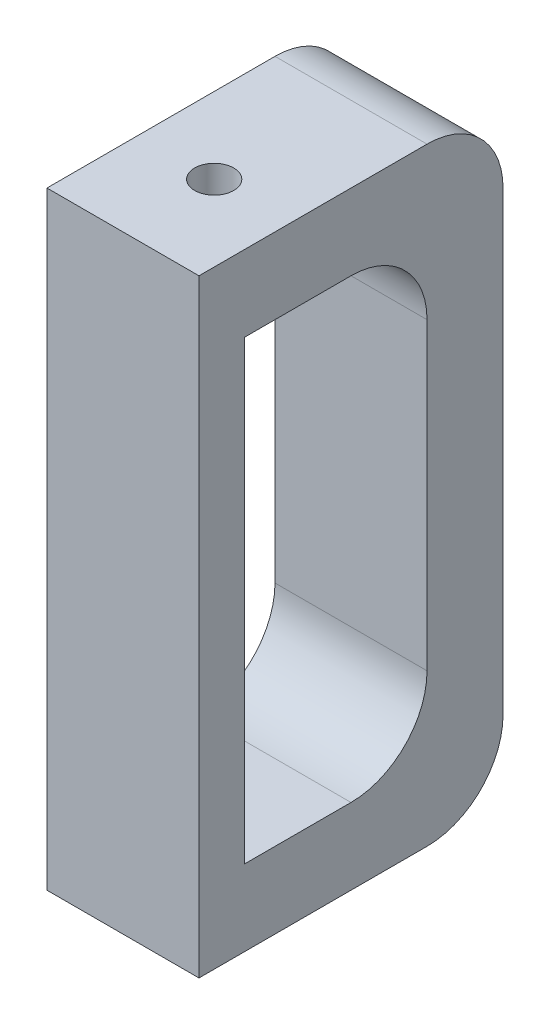
ISO-10303-21;
HEADER;
FILE_DESCRIPTION(('STEP AP214'),'2;1');
FILE_NAME('part.step','',(''),(''),'','','');
FILE_SCHEMA(('AUTOMOTIVE_DESIGN { 1 0 10303 214 1 1 1 1 }'));
ENDSEC;
DATA;
#1=APPLICATION_CONTEXT('core data for automotive mechanical design processes');
#2=APPLICATION_PROTOCOL_DEFINITION('international standard','automotive_design',2000,#1);
#3=PRODUCT_CONTEXT('',#1,'mechanical');
#4=PRODUCT('Part','Part','',(#3));
#5=PRODUCT_RELATED_PRODUCT_CATEGORY('part','',(#4));
#6=PRODUCT_DEFINITION_FORMATION('','',#4);
#7=PRODUCT_DEFINITION_CONTEXT('part definition',#1,'design');
#8=PRODUCT_DEFINITION('design','',#6,#7);
#9=PRODUCT_DEFINITION_SHAPE('','',#8);
#10=(LENGTH_UNIT() NAMED_UNIT(*) SI_UNIT(.MILLI.,.METRE.));
#11=(NAMED_UNIT(*) PLANE_ANGLE_UNIT() SI_UNIT($,.RADIAN.));
#12=(NAMED_UNIT(*) SI_UNIT($,.STERADIAN.) SOLID_ANGLE_UNIT());
#13=UNCERTAINTY_MEASURE_WITH_UNIT(LENGTH_MEASURE(1.E-05),#10,'distance_accuracy_value','');
#14=(GEOMETRIC_REPRESENTATION_CONTEXT(3) GLOBAL_UNCERTAINTY_ASSIGNED_CONTEXT((#13)) GLOBAL_UNIT_ASSIGNED_CONTEXT((#10,
#11,#12)) REPRESENTATION_CONTEXT('',''));
#15=CARTESIAN_POINT('',(0.,0.,0.));
#16=DIRECTION('',(0.,0.,1.));
#17=DIRECTION('',(1.,0.,0.));
#18=AXIS2_PLACEMENT_3D('',#15,#16,#17);
#19=CARTESIAN_POINT('',(0.,-101.6,0.));
#20=DIRECTION('',(0.,1.,0.));
#21=DIRECTION('',(0.,0.,1.));
#22=AXIS2_PLACEMENT_3D('',#19,#20,#21);
#23=PLANE('',#22);
#24=CARTESIAN_POINT('',(3.175,-101.6,-17.399));
#25=DIRECTION('',(0.,1.,0.));
#26=DIRECTION('',(0.,0.,1.));
#27=AXIS2_PLACEMENT_3D('',#24,#25,#26);
#28=CIRCLE('',#27,3.2639);
#29=CARTESIAN_POINT('',(3.175,-101.6,-14.1351));
#30=VERTEX_POINT('',#29);
#31=EDGE_CURVE('E339',#30,#30,#28,.F.);
#32=ORIENTED_EDGE('',*,*,#31,.F.);
#33=EDGE_LOOP('',(#32));
#34=FACE_BOUND('',#33,.T.);
#35=DIRECTION('',(-1.,0.,0.));
#36=VECTOR('',#35,1.);
#37=CARTESIAN_POINT('',(15.875,-101.6,-2.159));
#38=LINE('',#37,#36);
#39=CARTESIAN_POINT('',(15.875,-101.6,-2.159));
#40=VERTEX_POINT('',#39);
#41=CARTESIAN_POINT('',(-9.52500000000001,-101.6,-2.159));
#42=VERTEX_POINT('',#41);
#43=EDGE_CURVE('E245',#40,#42,#38,.T.);
#44=ORIENTED_EDGE('',*,*,#43,.T.);
#45=DIRECTION('',(0.,0.,1.));
#46=VECTOR('',#45,1.);
#47=CARTESIAN_POINT('',(-9.52500000000002,-101.6,-52.959));
#48=LINE('',#47,#46);
#49=CARTESIAN_POINT('',(-9.52500000000001,-101.6,-40.259));
#50=VERTEX_POINT('',#49);
#51=EDGE_CURVE('E50',#50,#42,#48,.T.);
#52=ORIENTED_EDGE('',*,*,#51,.F.);
#53=DIRECTION('',(1.,0.,0.));
#54=VECTOR('',#53,1.);
#55=CARTESIAN_POINT('',(-9.52500000000001,-101.6,-40.259));
#56=LINE('',#55,#54);
#57=CARTESIAN_POINT('',(15.875,-101.6,-40.259));
#58=VERTEX_POINT('',#57);
#59=EDGE_CURVE('E225',#50,#58,#56,.T.);
#60=ORIENTED_EDGE('',*,*,#59,.T.);
#61=DIRECTION('',(0.,0.,1.));
#62=VECTOR('',#61,1.);
#63=CARTESIAN_POINT('',(15.875,-101.6,-52.959));
#64=LINE('',#63,#62);
#65=EDGE_CURVE('E11',#58,#40,#64,.T.);
#66=ORIENTED_EDGE('',*,*,#65,.T.);
#67=EDGE_LOOP('',(#44,#52,#60,#66));
#68=FACE_BOUND('',#67,.T.);
#69=ADVANCED_FACE('F40',(#34,#68),#23,.F.);
#70=CARTESIAN_POINT('',(0.,0.,0.));
#71=DIRECTION('',(0.,1.,0.));
#72=DIRECTION('',(0.,0.,1.));
#73=AXIS2_PLACEMENT_3D('',#70,#71,#72);
#74=PLANE('',#73);
#75=DIRECTION('',(1.,0.,0.));
#76=VECTOR('',#75,1.);
#77=CARTESIAN_POINT('',(15.875,0.,-2.159));
#78=LINE('',#77,#76);
#79=CARTESIAN_POINT('',(-9.525,0.,-2.159));
#80=VERTEX_POINT('',#79);
#81=CARTESIAN_POINT('',(15.875,0.,-2.159));
#82=VERTEX_POINT('',#81);
#83=EDGE_CURVE('E237',#80,#82,#78,.T.);
#84=ORIENTED_EDGE('',*,*,#83,.T.);
#85=DIRECTION('',(0.,0.,1.));
#86=VECTOR('',#85,1.);
#87=CARTESIAN_POINT('',(15.875,0.,-52.959));
#88=LINE('',#87,#86);
#89=CARTESIAN_POINT('',(15.875,0.,-40.259));
#90=VERTEX_POINT('',#89);
#91=EDGE_CURVE('E241',#90,#82,#88,.T.);
#92=ORIENTED_EDGE('',*,*,#91,.F.);
#93=DIRECTION('',(1.,0.,0.));
#94=VECTOR('',#93,1.);
#95=CARTESIAN_POINT('',(-9.525,0.,-40.259));
#96=LINE('',#95,#94);
#97=CARTESIAN_POINT('',(-9.525,0.,-40.259));
#98=VERTEX_POINT('',#97);
#99=EDGE_CURVE('E208',#98,#90,#96,.T.);
#100=ORIENTED_EDGE('',*,*,#99,.F.);
#101=DIRECTION('',(0.,0.,1.));
#102=VECTOR('',#101,1.);
#103=CARTESIAN_POINT('',(-9.52500000000001,0.,-52.959));
#104=LINE('',#103,#102);
#105=EDGE_CURVE('E257',#98,#80,#104,.T.);
#106=ORIENTED_EDGE('',*,*,#105,.T.);
#107=EDGE_LOOP('',(#84,#92,#100,#106));
#108=FACE_BOUND('',#107,.T.);
#109=CARTESIAN_POINT('',(3.175,0.,-17.399));
#110=DIRECTION('',(0.,1.,0.));
#111=DIRECTION('',(0.,0.,1.));
#112=AXIS2_PLACEMENT_3D('',#109,#110,#111);
#113=CIRCLE('',#112,3.2639);
#114=CARTESIAN_POINT('',(3.175,0.,-14.1351));
#115=VERTEX_POINT('',#114);
#116=EDGE_CURVE('E347',#115,#115,#113,.T.);
#117=ORIENTED_EDGE('',*,*,#116,.F.);
#118=EDGE_LOOP('',(#117));
#119=FACE_BOUND('',#118,.T.);
#120=ADVANCED_FACE('F42',(#108,#119),#74,.T.);
#121=CARTESIAN_POINT('',(15.875,0.,-52.959));
#122=DIRECTION('',(-1.,0.,0.));
#123=DIRECTION('',(0.,0.,1.));
#124=AXIS2_PLACEMENT_3D('',#121,#122,#123);
#125=PLANE('',#124);
#126=CARTESIAN_POINT('',(15.875,-25.4,-27.559));
#127=DIRECTION('',(1.,0.,0.));
#128=DIRECTION('',(0.,0.,-1.));
#129=AXIS2_PLACEMENT_3D('',#126,#127,#128);
#130=CIRCLE('',#129,12.7);
#131=CARTESIAN_POINT('',(15.875,-25.4,-40.259));
#132=VERTEX_POINT('',#131);
#133=CARTESIAN_POINT('',(15.875,-12.7,-27.559));
#134=VERTEX_POINT('',#133);
#135=EDGE_CURVE('E175',#132,#134,#130,.T.);
#136=ORIENTED_EDGE('',*,*,#135,.F.);
#137=DIRECTION('',(0.,1.,0.));
#138=VECTOR('',#137,1.);
#139=CARTESIAN_POINT('',(15.875,0.,-40.259));
#140=LINE('',#139,#138);
#141=CARTESIAN_POINT('',(15.875,-76.2,-40.259));
#142=VERTEX_POINT('',#141);
#143=EDGE_CURVE('E57',#142,#132,#140,.T.);
#144=ORIENTED_EDGE('',*,*,#143,.F.);
#145=CARTESIAN_POINT('',(15.875,-76.2,-27.559));
#146=DIRECTION('',(1.,0.,0.));
#147=DIRECTION('',(0.,0.,-1.));
#148=AXIS2_PLACEMENT_3D('',#145,#146,#147);
#149=CIRCLE('',#148,12.7);
#150=CARTESIAN_POINT('',(15.875,-88.9,-27.559));
#151=VERTEX_POINT('',#150);
#152=EDGE_CURVE('E152',#151,#142,#149,.T.);
#153=ORIENTED_EDGE('',*,*,#152,.F.);
#154=DIRECTION('',(0.,0.,-1.));
#155=VECTOR('',#154,1.);
#156=CARTESIAN_POINT('',(15.875,-88.9,0.));
#157=LINE('',#156,#155);
#158=CARTESIAN_POINT('',(15.875,-88.9,-9.77900000000001));
#159=VERTEX_POINT('',#158);
#160=EDGE_CURVE('E156',#159,#151,#157,.T.);
#161=ORIENTED_EDGE('',*,*,#160,.F.);
#162=DIRECTION('',(0.,-1.,0.));
#163=VECTOR('',#162,1.);
#164=CARTESIAN_POINT('',(15.875,0.,-9.779));
#165=LINE('',#164,#163);
#166=CARTESIAN_POINT('',(15.875,-12.7,-9.779));
#167=VERTEX_POINT('',#166);
#168=EDGE_CURVE('E182',#167,#159,#165,.T.);
#169=ORIENTED_EDGE('',*,*,#168,.F.);
#170=DIRECTION('',(0.,0.,1.));
#171=VECTOR('',#170,1.);
#172=CARTESIAN_POINT('',(15.875,-12.7,0.));
#173=LINE('',#172,#171);
#174=EDGE_CURVE('E178',#134,#167,#173,.T.);
#175=ORIENTED_EDGE('',*,*,#174,.F.);
#176=EDGE_LOOP('',(#136,#144,#153,#161,#169,#175));
#177=FACE_BOUND('',#176,.T.);
#178=DIRECTION('',(0.,-1.,0.));
#179=VECTOR('',#178,1.);
#180=CARTESIAN_POINT('',(15.875,0.,-52.959));
#181=LINE('',#180,#179);
#182=CARTESIAN_POINT('',(15.875,-12.7,-52.959));
#183=VERTEX_POINT('',#182);
#184=CARTESIAN_POINT('',(15.875,-88.9,-52.959));
#185=VERTEX_POINT('',#184);
#186=EDGE_CURVE('E232',#183,#185,#181,.T.);
#187=ORIENTED_EDGE('',*,*,#186,.F.);
#188=CARTESIAN_POINT('',(15.875,-12.7,-40.259));
#189=DIRECTION('',(1.,0.,0.));
#190=DIRECTION('',(0.,0.,-1.));
#191=AXIS2_PLACEMENT_3D('',#188,#189,#190);
#192=CIRCLE('',#191,12.7);
#193=EDGE_CURVE('E192',#90,#183,#192,.F.);
#194=ORIENTED_EDGE('',*,*,#193,.F.);
#195=ORIENTED_EDGE('',*,*,#91,.T.);
#196=DIRECTION('',(0.,-1.,0.));
#197=VECTOR('',#196,1.);
#198=CARTESIAN_POINT('',(15.875,0.,-2.159));
#199=LINE('',#198,#197);
#200=EDGE_CURVE('E229',#82,#40,#199,.T.);
#201=ORIENTED_EDGE('',*,*,#200,.T.);
#202=ORIENTED_EDGE('',*,*,#65,.F.);
#203=CARTESIAN_POINT('',(15.875,-88.9,-40.259));
#204=DIRECTION('',(1.,0.,0.));
#205=DIRECTION('',(0.,0.,-1.));
#206=AXIS2_PLACEMENT_3D('',#203,#204,#205);
#207=CIRCLE('',#206,12.7);
#208=EDGE_CURVE('E215',#185,#58,#207,.F.);
#209=ORIENTED_EDGE('',*,*,#208,.F.);
#210=EDGE_LOOP('',(#187,#194,#195,#201,#202,#209));
#211=FACE_BOUND('',#210,.T.);
#212=ADVANCED_FACE('F279',(#177,#211),#125,.F.);
#213=CARTESIAN_POINT('',(-9.52500000000001,0.,-52.959));
#214=DIRECTION('',(1.,0.,0.));
#215=DIRECTION('',(0.,0.,-1.));
#216=AXIS2_PLACEMENT_3D('',#213,#214,#215);
#217=PLANE('',#216);
#218=CARTESIAN_POINT('',(-9.52500000000001,-76.2,-27.559));
#219=DIRECTION('',(1.,0.,0.));
#220=DIRECTION('',(0.,0.,-1.));
#221=AXIS2_PLACEMENT_3D('',#218,#219,#220);
#222=CIRCLE('',#221,12.7);
#223=CARTESIAN_POINT('',(-9.52500000000001,-88.9,-27.559));
#224=VERTEX_POINT('',#223);
#225=CARTESIAN_POINT('',(-9.52500000000001,-76.2,-40.259));
#226=VERTEX_POINT('',#225);
#227=EDGE_CURVE('E139',#224,#226,#222,.T.);
#228=ORIENTED_EDGE('',*,*,#227,.T.);
#229=DIRECTION('',(0.,1.,0.));
#230=VECTOR('',#229,1.);
#231=CARTESIAN_POINT('',(-9.525,0.,-40.259));
#232=LINE('',#231,#230);
#233=CARTESIAN_POINT('',(-9.52500000000001,-25.4,-40.259));
#234=VERTEX_POINT('',#233);
#235=EDGE_CURVE('E132',#226,#234,#232,.T.);
#236=ORIENTED_EDGE('',*,*,#235,.T.);
#237=CARTESIAN_POINT('',(-9.52500000000001,-25.4,-27.559));
#238=DIRECTION('',(1.,0.,0.));
#239=DIRECTION('',(0.,0.,-1.));
#240=AXIS2_PLACEMENT_3D('',#237,#238,#239);
#241=CIRCLE('',#240,12.7);
#242=CARTESIAN_POINT('',(-9.525,-12.7,-27.559));
#243=VERTEX_POINT('',#242);
#244=EDGE_CURVE('E142',#234,#243,#241,.T.);
#245=ORIENTED_EDGE('',*,*,#244,.T.);
#246=DIRECTION('',(0.,0.,1.));
#247=VECTOR('',#246,1.);
#248=CARTESIAN_POINT('',(-9.525,-12.7,0.));
#249=LINE('',#248,#247);
#250=CARTESIAN_POINT('',(-9.525,-12.7,-9.779));
#251=VERTEX_POINT('',#250);
#252=EDGE_CURVE('E65',#243,#251,#249,.T.);
#253=ORIENTED_EDGE('',*,*,#252,.T.);
#254=DIRECTION('',(0.,-1.,0.));
#255=VECTOR('',#254,1.);
#256=CARTESIAN_POINT('',(-9.525,0.,-9.779));
#257=LINE('',#256,#255);
#258=CARTESIAN_POINT('',(-9.52500000000001,-88.9,-9.77900000000001));
#259=VERTEX_POINT('',#258);
#260=EDGE_CURVE('E164',#251,#259,#257,.T.);
#261=ORIENTED_EDGE('',*,*,#260,.T.);
#262=DIRECTION('',(0.,0.,-1.));
#263=VECTOR('',#262,1.);
#264=CARTESIAN_POINT('',(-9.52500000000001,-88.9,0.));
#265=LINE('',#264,#263);
#266=EDGE_CURVE('E168',#259,#224,#265,.T.);
#267=ORIENTED_EDGE('',*,*,#266,.T.);
#268=EDGE_LOOP('',(#228,#236,#245,#253,#261,#267));
#269=FACE_BOUND('',#268,.T.);
#270=ORIENTED_EDGE('',*,*,#105,.F.);
#271=CARTESIAN_POINT('',(-9.52500000000001,-12.7,-40.259));
#272=DIRECTION('',(1.,0.,0.));
#273=DIRECTION('',(0.,0.,-1.));
#274=AXIS2_PLACEMENT_3D('',#271,#272,#273);
#275=CIRCLE('',#274,12.7);
#276=CARTESIAN_POINT('',(-9.52500000000001,-12.7,-52.959));
#277=VERTEX_POINT('',#276);
#278=EDGE_CURVE('E204',#98,#277,#275,.F.);
#279=ORIENTED_EDGE('',*,*,#278,.T.);
#280=DIRECTION('',(0.,1.,0.));
#281=VECTOR('',#280,1.);
#282=CARTESIAN_POINT('',(-9.52500000000001,0.,-52.959));
#283=LINE('',#282,#281);
#284=CARTESIAN_POINT('',(-9.52500000000002,-88.9,-52.959));
#285=VERTEX_POINT('',#284);
#286=EDGE_CURVE('E236',#285,#277,#283,.T.);
#287=ORIENTED_EDGE('',*,*,#286,.F.);
#288=CARTESIAN_POINT('',(-9.52500000000001,-88.9,-40.259));
#289=DIRECTION('',(1.,0.,0.));
#290=DIRECTION('',(0.,0.,-1.));
#291=AXIS2_PLACEMENT_3D('',#288,#289,#290);
#292=CIRCLE('',#291,12.7);
#293=EDGE_CURVE('E218',#285,#50,#292,.F.);
#294=ORIENTED_EDGE('',*,*,#293,.T.);
#295=ORIENTED_EDGE('',*,*,#51,.T.);
#296=DIRECTION('',(0.,1.,0.));
#297=VECTOR('',#296,1.);
#298=CARTESIAN_POINT('',(-9.525,0.,-2.159));
#299=LINE('',#298,#297);
#300=EDGE_CURVE('E248',#42,#80,#299,.T.);
#301=ORIENTED_EDGE('',*,*,#300,.T.);
#302=EDGE_LOOP('',(#270,#279,#287,#294,#295,#301));
#303=FACE_BOUND('',#302,.T.);
#304=ADVANCED_FACE('F147',(#269,#303),#217,.F.);
#305=CARTESIAN_POINT('',(0.,0.,-52.959));
#306=DIRECTION('',(0.,0.,-1.));
#307=DIRECTION('',(-1.,0.,0.));
#308=AXIS2_PLACEMENT_3D('',#305,#306,#307);
#309=PLANE('',#308);
#310=DIRECTION('',(1.,0.,0.));
#311=VECTOR('',#310,1.);
#312=CARTESIAN_POINT('',(-9.52500000000001,-12.7,-52.959));
#313=LINE('',#312,#311);
#314=EDGE_CURVE('E211',#277,#183,#313,.T.);
#315=ORIENTED_EDGE('',*,*,#314,.T.);
#316=ORIENTED_EDGE('',*,*,#186,.T.);
#317=DIRECTION('',(1.,0.,0.));
#318=VECTOR('',#317,1.);
#319=CARTESIAN_POINT('',(-9.52500000000002,-88.9,-52.959));
#320=LINE('',#319,#318);
#321=EDGE_CURVE('E222',#285,#185,#320,.T.);
#322=ORIENTED_EDGE('',*,*,#321,.F.);
#323=ORIENTED_EDGE('',*,*,#286,.T.);
#324=EDGE_LOOP('',(#315,#316,#322,#323));
#325=FACE_BOUND('',#324,.T.);
#326=ADVANCED_FACE('F285',(#325),#309,.T.);
#327=CARTESIAN_POINT('',(0.,0.,-2.159));
#328=DIRECTION('',(0.,0.,-1.));
#329=DIRECTION('',(-1.,0.,0.));
#330=AXIS2_PLACEMENT_3D('',#327,#328,#329);
#331=PLANE('',#330);
#332=ORIENTED_EDGE('',*,*,#300,.F.);
#333=ORIENTED_EDGE('',*,*,#43,.F.);
#334=ORIENTED_EDGE('',*,*,#200,.F.);
#335=ORIENTED_EDGE('',*,*,#83,.F.);
#336=EDGE_LOOP('',(#332,#333,#334,#335));
#337=FACE_BOUND('',#336,.T.);
#338=ADVANCED_FACE('F270',(#337),#331,.F.);
#339=CARTESIAN_POINT('',(-9.52500000000001,-88.9,-40.259));
#340=DIRECTION('',(1.,0.,0.));
#341=DIRECTION('',(0.,0.,-1.));
#342=AXIS2_PLACEMENT_3D('',#339,#340,#341);
#343=CYLINDRICAL_SURFACE('',#342,12.7);
#344=ORIENTED_EDGE('',*,*,#208,.T.);
#345=ORIENTED_EDGE('',*,*,#59,.F.);
#346=ORIENTED_EDGE('',*,*,#293,.F.);
#347=ORIENTED_EDGE('',*,*,#321,.T.);
#348=EDGE_LOOP('',(#344,#345,#346,#347));
#349=FACE_BOUND('',#348,.T.);
#350=ADVANCED_FACE('F288',(#349),#343,.T.);
#351=CARTESIAN_POINT('',(-9.52500000000001,-12.7,-40.259));
#352=DIRECTION('',(1.,0.,0.));
#353=DIRECTION('',(0.,0.,-1.));
#354=AXIS2_PLACEMENT_3D('',#351,#352,#353);
#355=CYLINDRICAL_SURFACE('',#354,12.7);
#356=ORIENTED_EDGE('',*,*,#193,.T.);
#357=ORIENTED_EDGE('',*,*,#314,.F.);
#358=ORIENTED_EDGE('',*,*,#278,.F.);
#359=ORIENTED_EDGE('',*,*,#99,.T.);
#360=EDGE_LOOP('',(#356,#357,#358,#359));
#361=FACE_BOUND('',#360,.T.);
#362=ADVANCED_FACE('F283',(#361),#355,.T.);
#363=CARTESIAN_POINT('',(-9.525,0.,-40.259));
#364=DIRECTION('',(0.,0.,-1.));
#365=DIRECTION('',(0.,1.,0.));
#366=AXIS2_PLACEMENT_3D('',#363,#364,#365);
#367=PLANE('',#366);
#368=ORIENTED_EDGE('',*,*,#143,.T.);
#369=DIRECTION('',(1.,0.,0.));
#370=VECTOR('',#369,1.);
#371=CARTESIAN_POINT('',(-9.52500000000001,-25.4,-40.259));
#372=LINE('',#371,#370);
#373=EDGE_CURVE('E128',#234,#132,#372,.T.);
#374=ORIENTED_EDGE('',*,*,#373,.F.);
#375=ORIENTED_EDGE('',*,*,#235,.F.);
#376=DIRECTION('',(1.,0.,0.));
#377=VECTOR('',#376,1.);
#378=CARTESIAN_POINT('',(-9.52500000000001,-76.2,-40.259));
#379=LINE('',#378,#377);
#380=EDGE_CURVE('E189',#226,#142,#379,.T.);
#381=ORIENTED_EDGE('',*,*,#380,.T.);
#382=EDGE_LOOP('',(#368,#374,#375,#381));
#383=FACE_BOUND('',#382,.T.);
#384=ADVANCED_FACE('F130',(#383),#367,.F.);
#385=CARTESIAN_POINT('',(-9.52500000000001,-76.2,-27.559));
#386=DIRECTION('',(1.,0.,0.));
#387=DIRECTION('',(0.,0.,-1.));
#388=AXIS2_PLACEMENT_3D('',#385,#386,#387);
#389=CYLINDRICAL_SURFACE('',#388,12.7);
#390=ORIENTED_EDGE('',*,*,#152,.T.);
#391=ORIENTED_EDGE('',*,*,#380,.F.);
#392=ORIENTED_EDGE('',*,*,#227,.F.);
#393=DIRECTION('',(1.,0.,0.));
#394=VECTOR('',#393,1.);
#395=CARTESIAN_POINT('',(-9.52500000000001,-88.9,-27.559));
#396=LINE('',#395,#394);
#397=EDGE_CURVE('E193',#224,#151,#396,.T.);
#398=ORIENTED_EDGE('',*,*,#397,.T.);
#399=EDGE_LOOP('',(#390,#391,#392,#398));
#400=FACE_BOUND('',#399,.T.);
#401=ADVANCED_FACE('F311',(#400),#389,.F.);
#402=CARTESIAN_POINT('',(-9.52500000000001,-88.9,0.));
#403=DIRECTION('',(0.,-1.,0.));
#404=DIRECTION('',(0.,0.,-1.));
#405=AXIS2_PLACEMENT_3D('',#402,#403,#404);
#406=PLANE('',#405);
#407=CARTESIAN_POINT('',(3.175,-88.9,-17.399));
#408=DIRECTION('',(0.,-1.,0.));
#409=DIRECTION('',(0.,0.,-1.));
#410=AXIS2_PLACEMENT_3D('',#407,#408,#409);
#411=CIRCLE('',#410,3.2639);
#412=CARTESIAN_POINT('',(3.175,-88.9,-20.6629));
#413=VERTEX_POINT('',#412);
#414=EDGE_CURVE('E159',#413,#413,#411,.T.);
#415=ORIENTED_EDGE('',*,*,#414,.T.);
#416=EDGE_LOOP('',(#415));
#417=FACE_BOUND('',#416,.T.);
#418=ORIENTED_EDGE('',*,*,#160,.T.);
#419=ORIENTED_EDGE('',*,*,#397,.F.);
#420=ORIENTED_EDGE('',*,*,#266,.F.);
#421=DIRECTION('',(1.,0.,0.));
#422=VECTOR('',#421,1.);
#423=CARTESIAN_POINT('',(-9.52500000000001,-88.9,-9.77900000000001));
#424=LINE('',#423,#422);
#425=EDGE_CURVE('E196',#259,#159,#424,.T.);
#426=ORIENTED_EDGE('',*,*,#425,.T.);
#427=EDGE_LOOP('',(#418,#419,#420,#426));
#428=FACE_BOUND('',#427,.T.);
#429=ADVANCED_FACE('F322',(#417,#428),#406,.F.);
#430=CARTESIAN_POINT('',(-9.525,0.,-9.779));
#431=DIRECTION('',(0.,0.,1.));
#432=DIRECTION('',(1.,0.,0.));
#433=AXIS2_PLACEMENT_3D('',#430,#431,#432);
#434=PLANE('',#433);
#435=ORIENTED_EDGE('',*,*,#168,.T.);
#436=ORIENTED_EDGE('',*,*,#425,.F.);
#437=ORIENTED_EDGE('',*,*,#260,.F.);
#438=DIRECTION('',(1.,0.,0.));
#439=VECTOR('',#438,1.);
#440=CARTESIAN_POINT('',(-9.525,-12.7,-9.779));
#441=LINE('',#440,#439);
#442=EDGE_CURVE('E199',#251,#167,#441,.T.);
#443=ORIENTED_EDGE('',*,*,#442,.T.);
#444=EDGE_LOOP('',(#435,#436,#437,#443));
#445=FACE_BOUND('',#444,.T.);
#446=ADVANCED_FACE('F318',(#445),#434,.F.);
#447=CARTESIAN_POINT('',(-9.525,-12.7,0.));
#448=DIRECTION('',(0.,1.,0.));
#449=DIRECTION('',(-1.,0.,0.));
#450=AXIS2_PLACEMENT_3D('',#447,#448,#449);
#451=PLANE('',#450);
#452=CARTESIAN_POINT('',(3.175,-12.7,-17.399));
#453=DIRECTION('',(0.,1.,0.));
#454=DIRECTION('',(-1.,0.,0.));
#455=AXIS2_PLACEMENT_3D('',#452,#453,#454);
#456=CIRCLE('',#455,3.2639);
#457=CARTESIAN_POINT('',(-0.0889000000000024,-12.7,-17.399));
#458=VERTEX_POINT('',#457);
#459=EDGE_CURVE('E44',#458,#458,#456,.T.);
#460=ORIENTED_EDGE('',*,*,#459,.T.);
#461=EDGE_LOOP('',(#460));
#462=FACE_BOUND('',#461,.T.);
#463=ORIENTED_EDGE('',*,*,#174,.T.);
#464=ORIENTED_EDGE('',*,*,#442,.F.);
#465=ORIENTED_EDGE('',*,*,#252,.F.);
#466=DIRECTION('',(1.,0.,0.));
#467=VECTOR('',#466,1.);
#468=CARTESIAN_POINT('',(-9.525,-12.7,-27.559));
#469=LINE('',#468,#467);
#470=EDGE_CURVE('E138',#243,#134,#469,.T.);
#471=ORIENTED_EDGE('',*,*,#470,.T.);
#472=EDGE_LOOP('',(#463,#464,#465,#471));
#473=FACE_BOUND('',#472,.T.);
#474=ADVANCED_FACE('F315',(#462,#473),#451,.F.);
#475=CARTESIAN_POINT('',(-9.52500000000001,-25.4,-27.559));
#476=DIRECTION('',(1.,0.,0.));
#477=DIRECTION('',(0.,0.,-1.));
#478=AXIS2_PLACEMENT_3D('',#475,#476,#477);
#479=CYLINDRICAL_SURFACE('',#478,12.7);
#480=ORIENTED_EDGE('',*,*,#135,.T.);
#481=ORIENTED_EDGE('',*,*,#470,.F.);
#482=ORIENTED_EDGE('',*,*,#244,.F.);
#483=ORIENTED_EDGE('',*,*,#373,.T.);
#484=EDGE_LOOP('',(#480,#481,#482,#483));
#485=FACE_BOUND('',#484,.T.);
#486=ADVANCED_FACE('F143',(#485),#479,.F.);
#487=CARTESIAN_POINT('',(3.175,-110.831703292459,-17.399));
#488=DIRECTION('',(0.,1.,0.));
#489=DIRECTION('',(0.,0.,1.));
#490=AXIS2_PLACEMENT_3D('',#487,#488,#489);
#491=CYLINDRICAL_SURFACE('',#490,3.2639);
#492=ORIENTED_EDGE('',*,*,#116,.T.);
#493=EDGE_LOOP('',(#492));
#494=FACE_BOUND('',#493,.T.);
#495=ORIENTED_EDGE('',*,*,#459,.F.);
#496=EDGE_LOOP('',(#495));
#497=FACE_BOUND('',#496,.T.);
#498=ADVANCED_FACE('F314',(#494,#497),#491,.F.);
#499=ORIENTED_EDGE('',*,*,#31,.T.);
#500=EDGE_LOOP('',(#499));
#501=FACE_BOUND('',#500,.T.);
#502=ORIENTED_EDGE('',*,*,#414,.F.);
#503=EDGE_LOOP('',(#502));
#504=FACE_BOUND('',#503,.T.);
#505=ADVANCED_FACE('F330',(#501,#504),#491,.F.);
#506=CLOSED_SHELL('',(#69,#120,#212,#304,#326,#338,#350,#362,#384,#401,#429,#446,#474,#486,#498,#505));
#507=MANIFOLD_SOLID_BREP('B2',#506);
#508=ADVANCED_BREP_SHAPE_REPRESENTATION('',(#18,#507),#14);
#509=SHAPE_DEFINITION_REPRESENTATION(#9,#508);
ENDSEC;
END-ISO-10303-21;
